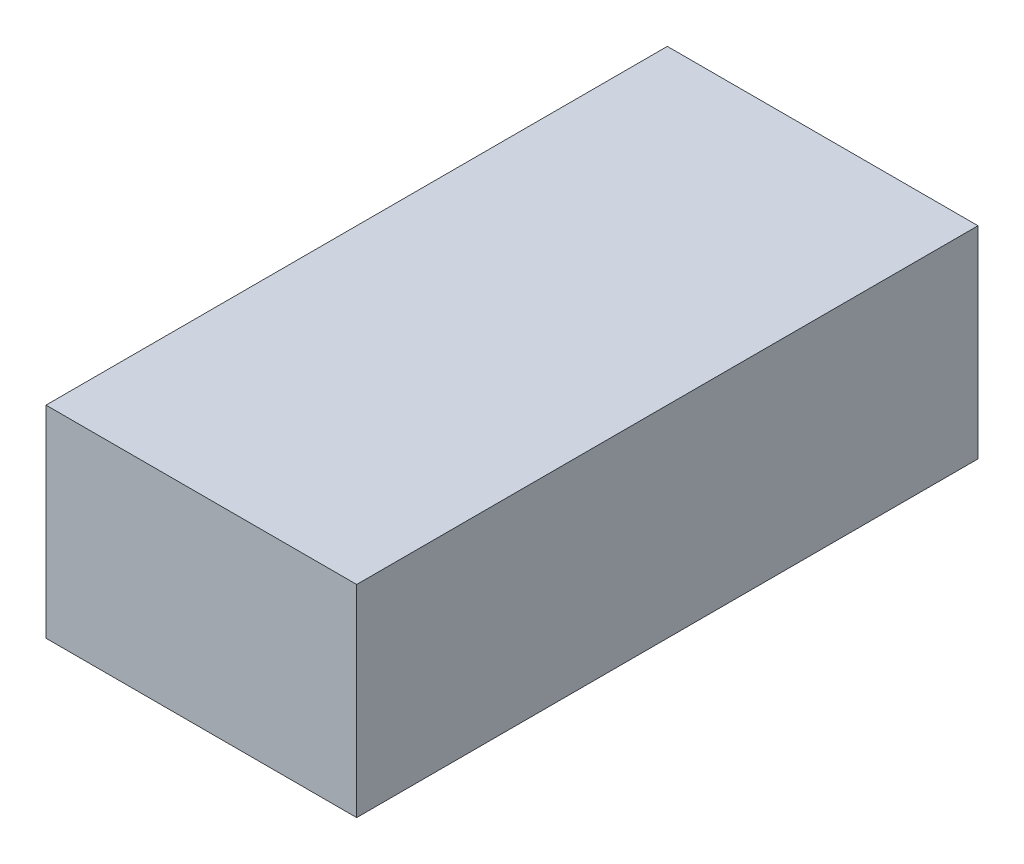
ISO-10303-21;
HEADER;
FILE_DESCRIPTION(('STEP AP214'),'2;1');
FILE_NAME('part.step','',(''),(''),'','','');
FILE_SCHEMA(('AUTOMOTIVE_DESIGN { 1 0 10303 214 1 1 1 1 }'));
ENDSEC;
DATA;
#1=APPLICATION_CONTEXT('core data for automotive mechanical design processes');
#2=APPLICATION_PROTOCOL_DEFINITION('international standard','automotive_design',2000,#1);
#3=PRODUCT_CONTEXT('',#1,'mechanical');
#4=PRODUCT('Part','Part','',(#3));
#5=PRODUCT_RELATED_PRODUCT_CATEGORY('part','',(#4));
#6=PRODUCT_DEFINITION_FORMATION('','',#4);
#7=PRODUCT_DEFINITION_CONTEXT('part definition',#1,'design');
#8=PRODUCT_DEFINITION('design','',#6,#7);
#9=PRODUCT_DEFINITION_SHAPE('','',#8);
#10=(LENGTH_UNIT() NAMED_UNIT(*) SI_UNIT(.MILLI.,.METRE.));
#11=(NAMED_UNIT(*) PLANE_ANGLE_UNIT() SI_UNIT($,.RADIAN.));
#12=(NAMED_UNIT(*) SI_UNIT($,.STERADIAN.) SOLID_ANGLE_UNIT());
#13=UNCERTAINTY_MEASURE_WITH_UNIT(LENGTH_MEASURE(1.E-05),#10,'distance_accuracy_value','');
#14=(GEOMETRIC_REPRESENTATION_CONTEXT(3) GLOBAL_UNCERTAINTY_ASSIGNED_CONTEXT((#13)) GLOBAL_UNIT_ASSIGNED_CONTEXT((#10,
#11,#12)) REPRESENTATION_CONTEXT('',''));
#15=CARTESIAN_POINT('',(0.,0.,0.));
#16=DIRECTION('',(0.,0.,1.));
#17=DIRECTION('',(1.,0.,0.));
#18=AXIS2_PLACEMENT_3D('',#15,#16,#17);
#19=CARTESIAN_POINT('',(10.,-3.25,-9.99999999999999));
#20=DIRECTION('',(0.,0.,1.));
#21=DIRECTION('',(1.,0.,0.));
#22=AXIS2_PLACEMENT_3D('',#19,#20,#21);
#23=PLANE('',#22);
#24=DIRECTION('',(0.,1.,0.));
#25=VECTOR('',#24,1.);
#26=CARTESIAN_POINT('',(0.,-3.25,-9.99999999999999));
#27=LINE('',#26,#25);
#28=CARTESIAN_POINT('',(0.,-3.25,-9.99999999999999));
#29=VERTEX_POINT('',#28);
#30=CARTESIAN_POINT('',(0.,3.25,-9.99999999999999));
#31=VERTEX_POINT('',#30);
#32=EDGE_CURVE('E113',#29,#31,#27,.T.);
#33=ORIENTED_EDGE('',*,*,#32,.T.);
#34=DIRECTION('',(-1.,0.,0.));
#35=VECTOR('',#34,1.);
#36=CARTESIAN_POINT('',(10.,3.25,-9.99999999999999));
#37=LINE('',#36,#35);
#38=CARTESIAN_POINT('',(10.,3.25,-9.99999999999999));
#39=VERTEX_POINT('',#38);
#40=EDGE_CURVE('E11',#39,#31,#37,.T.);
#41=ORIENTED_EDGE('',*,*,#40,.F.);
#42=DIRECTION('',(0.,1.,0.));
#43=VECTOR('',#42,1.);
#44=CARTESIAN_POINT('',(10.,-3.25,-9.99999999999999));
#45=LINE('',#44,#43);
#46=CARTESIAN_POINT('',(10.,-3.25,-9.99999999999999));
#47=VERTEX_POINT('',#46);
#48=EDGE_CURVE('E97',#47,#39,#45,.T.);
#49=ORIENTED_EDGE('',*,*,#48,.F.);
#50=DIRECTION('',(-1.,0.,0.));
#51=VECTOR('',#50,1.);
#52=CARTESIAN_POINT('',(10.,-3.25,-9.99999999999999));
#53=LINE('',#52,#51);
#54=EDGE_CURVE('E109',#47,#29,#53,.T.);
#55=ORIENTED_EDGE('',*,*,#54,.T.);
#56=EDGE_LOOP('',(#33,#41,#49,#55));
#57=FACE_BOUND('',#56,.T.);
#58=ADVANCED_FACE('F45',(#57),#23,.F.);
#59=CARTESIAN_POINT('',(10.,3.25,10.));
#60=DIRECTION('',(0.,-1.,0.));
#61=DIRECTION('',(0.,0.,-1.));
#62=AXIS2_PLACEMENT_3D('',#59,#60,#61);
#63=PLANE('',#62);
#64=DIRECTION('',(0.,0.,1.));
#65=VECTOR('',#64,1.);
#66=CARTESIAN_POINT('',(0.,3.25,10.));
#67=LINE('',#66,#65);
#68=CARTESIAN_POINT('',(0.,3.25,10.));
#69=VERTEX_POINT('',#68);
#70=EDGE_CURVE('E102',#31,#69,#67,.T.);
#71=ORIENTED_EDGE('',*,*,#70,.T.);
#72=DIRECTION('',(-1.,0.,0.));
#73=VECTOR('',#72,1.);
#74=CARTESIAN_POINT('',(10.,3.25,10.));
#75=LINE('',#74,#73);
#76=CARTESIAN_POINT('',(10.,3.25,10.));
#77=VERTEX_POINT('',#76);
#78=EDGE_CURVE('E54',#77,#69,#75,.T.);
#79=ORIENTED_EDGE('',*,*,#78,.F.);
#80=DIRECTION('',(0.,0.,1.));
#81=VECTOR('',#80,1.);
#82=CARTESIAN_POINT('',(10.,3.25,10.));
#83=LINE('',#82,#81);
#84=EDGE_CURVE('E92',#39,#77,#83,.T.);
#85=ORIENTED_EDGE('',*,*,#84,.F.);
#86=ORIENTED_EDGE('',*,*,#40,.T.);
#87=EDGE_LOOP('',(#71,#79,#85,#86));
#88=FACE_BOUND('',#87,.T.);
#89=ADVANCED_FACE('F101',(#88),#63,.F.);
#90=CARTESIAN_POINT('',(10.,-3.25,10.));
#91=DIRECTION('',(0.,0.,-1.));
#92=DIRECTION('',(-1.,0.,0.));
#93=AXIS2_PLACEMENT_3D('',#90,#91,#92);
#94=PLANE('',#93);
#95=DIRECTION('',(0.,-1.,0.));
#96=VECTOR('',#95,1.);
#97=CARTESIAN_POINT('',(0.,-3.25,10.));
#98=LINE('',#97,#96);
#99=CARTESIAN_POINT('',(0.,-3.25,10.));
#100=VERTEX_POINT('',#99);
#101=EDGE_CURVE('E79',#69,#100,#98,.T.);
#102=ORIENTED_EDGE('',*,*,#101,.T.);
#103=DIRECTION('',(-1.,0.,0.));
#104=VECTOR('',#103,1.);
#105=CARTESIAN_POINT('',(10.,-3.25,10.));
#106=LINE('',#105,#104);
#107=CARTESIAN_POINT('',(10.,-3.25,10.));
#108=VERTEX_POINT('',#107);
#109=EDGE_CURVE('E104',#108,#100,#106,.T.);
#110=ORIENTED_EDGE('',*,*,#109,.F.);
#111=DIRECTION('',(0.,-1.,0.));
#112=VECTOR('',#111,1.);
#113=CARTESIAN_POINT('',(10.,-3.25,10.));
#114=LINE('',#113,#112);
#115=EDGE_CURVE('E95',#77,#108,#114,.T.);
#116=ORIENTED_EDGE('',*,*,#115,.F.);
#117=ORIENTED_EDGE('',*,*,#78,.T.);
#118=EDGE_LOOP('',(#102,#110,#116,#117));
#119=FACE_BOUND('',#118,.T.);
#120=ADVANCED_FACE('F105',(#119),#94,.F.);
#121=CARTESIAN_POINT('',(10.,-3.25,10.));
#122=DIRECTION('',(0.,1.,0.));
#123=DIRECTION('',(0.,0.,1.));
#124=AXIS2_PLACEMENT_3D('',#121,#122,#123);
#125=PLANE('',#124);
#126=DIRECTION('',(0.,0.,-1.));
#127=VECTOR('',#126,1.);
#128=CARTESIAN_POINT('',(0.,-3.25,10.));
#129=LINE('',#128,#127);
#130=EDGE_CURVE('E85',#100,#29,#129,.T.);
#131=ORIENTED_EDGE('',*,*,#130,.T.);
#132=ORIENTED_EDGE('',*,*,#54,.F.);
#133=DIRECTION('',(0.,0.,-1.));
#134=VECTOR('',#133,1.);
#135=CARTESIAN_POINT('',(10.,-3.25,10.));
#136=LINE('',#135,#134);
#137=EDGE_CURVE('E62',#108,#47,#136,.T.);
#138=ORIENTED_EDGE('',*,*,#137,.F.);
#139=ORIENTED_EDGE('',*,*,#109,.T.);
#140=EDGE_LOOP('',(#131,#132,#138,#139));
#141=FACE_BOUND('',#140,.T.);
#142=ADVANCED_FACE('F126',(#141),#125,.F.);
#143=CARTESIAN_POINT('',(10.,0.,0.));
#144=DIRECTION('',(-1.,0.,0.));
#145=DIRECTION('',(0.,0.,1.));
#146=AXIS2_PLACEMENT_3D('',#143,#144,#145);
#147=PLANE('',#146);
#148=ORIENTED_EDGE('',*,*,#48,.T.);
#149=ORIENTED_EDGE('',*,*,#84,.T.);
#150=ORIENTED_EDGE('',*,*,#115,.T.);
#151=ORIENTED_EDGE('',*,*,#137,.T.);
#152=EDGE_LOOP('',(#148,#149,#150,#151));
#153=FACE_BOUND('',#152,.T.);
#154=ADVANCED_FACE('F93',(#153),#147,.F.);
#155=CARTESIAN_POINT('',(0.,0.,0.));
#156=DIRECTION('',(-1.,0.,0.));
#157=DIRECTION('',(0.,0.,1.));
#158=AXIS2_PLACEMENT_3D('',#155,#156,#157);
#159=PLANE('',#158);
#160=ORIENTED_EDGE('',*,*,#32,.F.);
#161=ORIENTED_EDGE('',*,*,#130,.F.);
#162=ORIENTED_EDGE('',*,*,#101,.F.);
#163=ORIENTED_EDGE('',*,*,#70,.F.);
#164=EDGE_LOOP('',(#160,#161,#162,#163));
#165=FACE_BOUND('',#164,.T.);
#166=ADVANCED_FACE('F129',(#165),#159,.T.);
#167=CLOSED_SHELL('',(#58,#89,#120,#142,#154,#166));
#168=MANIFOLD_SOLID_BREP('B2',#167);
#169=ADVANCED_BREP_SHAPE_REPRESENTATION('',(#18,#168),#14);
#170=SHAPE_DEFINITION_REPRESENTATION(#9,#169);
ENDSEC;
END-ISO-10303-21;
